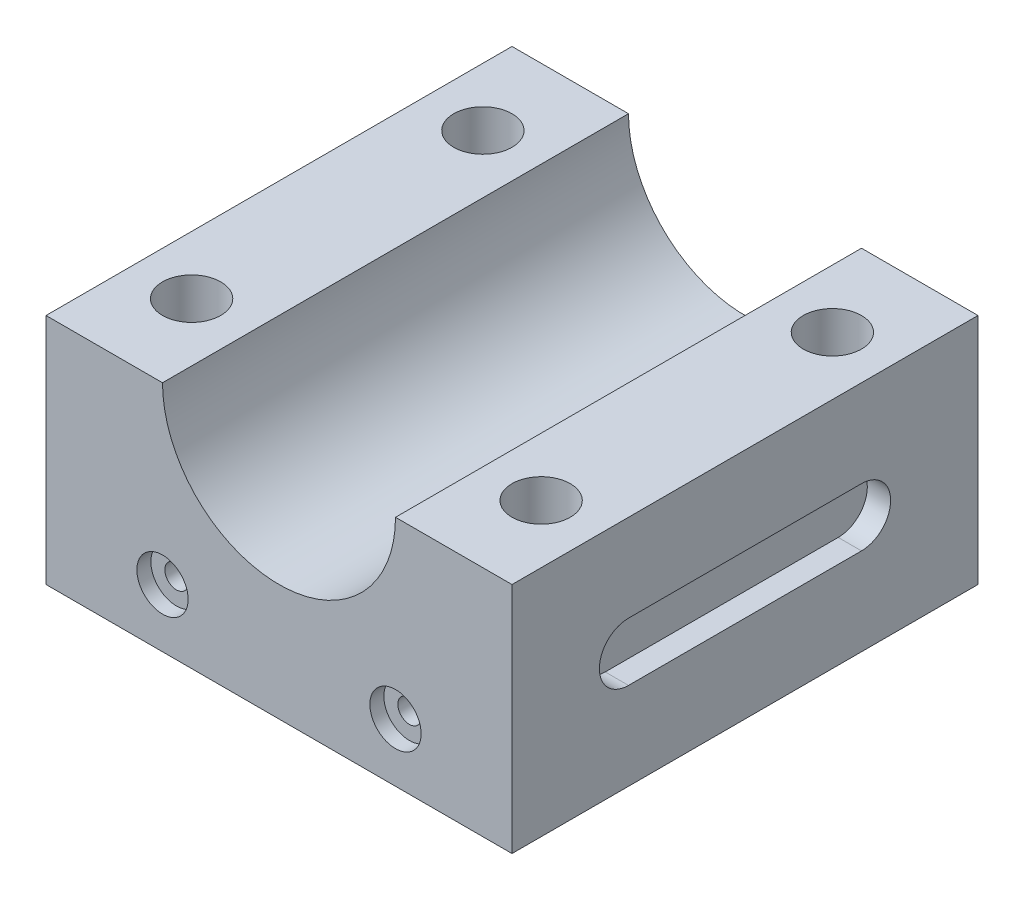
ISO-10303-21;
HEADER;
FILE_DESCRIPTION(('STEP AP214'),'2;1');
FILE_NAME('part.step','',(''),(''),'','','');
FILE_SCHEMA(('AUTOMOTIVE_DESIGN { 1 0 10303 214 1 1 1 1 }'));
ENDSEC;
DATA;
#1=APPLICATION_CONTEXT('core data for automotive mechanical design processes');
#2=APPLICATION_PROTOCOL_DEFINITION('international standard','automotive_design',2000,#1);
#3=PRODUCT_CONTEXT('',#1,'mechanical');
#4=PRODUCT('Part','Part','',(#3));
#5=PRODUCT_RELATED_PRODUCT_CATEGORY('part','',(#4));
#6=PRODUCT_DEFINITION_FORMATION('','',#4);
#7=PRODUCT_DEFINITION_CONTEXT('part definition',#1,'design');
#8=PRODUCT_DEFINITION('design','',#6,#7);
#9=PRODUCT_DEFINITION_SHAPE('','',#8);
#10=(LENGTH_UNIT() NAMED_UNIT(*) SI_UNIT(.MILLI.,.METRE.));
#11=(NAMED_UNIT(*) PLANE_ANGLE_UNIT() SI_UNIT($,.RADIAN.));
#12=(NAMED_UNIT(*) SI_UNIT($,.STERADIAN.) SOLID_ANGLE_UNIT());
#13=UNCERTAINTY_MEASURE_WITH_UNIT(LENGTH_MEASURE(1.E-05),#10,'distance_accuracy_value','');
#14=(GEOMETRIC_REPRESENTATION_CONTEXT(3) GLOBAL_UNCERTAINTY_ASSIGNED_CONTEXT((#13)) GLOBAL_UNIT_ASSIGNED_CONTEXT((#10,
#11,#12)) REPRESENTATION_CONTEXT('',''));
#15=CARTESIAN_POINT('',(0.,0.,0.));
#16=DIRECTION('',(0.,0.,1.));
#17=DIRECTION('',(1.,0.,0.));
#18=AXIS2_PLACEMENT_3D('',#15,#16,#17);
#19=CARTESIAN_POINT('',(50.8,-25.4,50.8));
#20=DIRECTION('',(-1.,0.,0.));
#21=DIRECTION('',(0.,0.,1.));
#22=AXIS2_PLACEMENT_3D('',#19,#20,#21);
#23=PLANE('',#22);
#24=DIRECTION('',(0.,0.,-1.));
#25=VECTOR('',#24,1.);
#26=CARTESIAN_POINT('',(50.8,-6.35,25.4));
#27=LINE('',#26,#25);
#28=CARTESIAN_POINT('',(50.8,-6.35,25.4));
#29=VERTEX_POINT('',#28);
#30=CARTESIAN_POINT('',(50.8,-6.34999999999999,-25.4));
#31=VERTEX_POINT('',#30);
#32=EDGE_CURVE('E229',#29,#31,#27,.T.);
#33=ORIENTED_EDGE('',*,*,#32,.F.);
#34=CARTESIAN_POINT('',(50.8,0.,25.4));
#35=DIRECTION('',(1.,0.,0.));
#36=DIRECTION('',(0.,0.,-1.));
#37=AXIS2_PLACEMENT_3D('',#34,#35,#36);
#38=CIRCLE('',#37,6.35);
#39=CARTESIAN_POINT('',(50.8,6.35,25.4));
#40=VERTEX_POINT('',#39);
#41=EDGE_CURVE('E53',#40,#29,#38,.T.);
#42=ORIENTED_EDGE('',*,*,#41,.F.);
#43=DIRECTION('',(0.,0.,1.));
#44=VECTOR('',#43,1.);
#45=CARTESIAN_POINT('',(50.8,6.35,25.4));
#46=LINE('',#45,#44);
#47=CARTESIAN_POINT('',(50.8,6.35000000000001,-25.4));
#48=VERTEX_POINT('',#47);
#49=EDGE_CURVE('E222',#48,#40,#46,.T.);
#50=ORIENTED_EDGE('',*,*,#49,.F.);
#51=CARTESIAN_POINT('',(50.8,0.,-25.4));
#52=DIRECTION('',(1.,0.,0.));
#53=DIRECTION('',(0.,0.,-1.));
#54=AXIS2_PLACEMENT_3D('',#51,#52,#53);
#55=CIRCLE('',#54,6.35);
#56=EDGE_CURVE('E226',#31,#48,#55,.T.);
#57=ORIENTED_EDGE('',*,*,#56,.F.);
#58=EDGE_LOOP('',(#33,#42,#50,#57));
#59=FACE_BOUND('',#58,.T.);
#60=DIRECTION('',(0.,1.,0.));
#61=VECTOR('',#60,1.);
#62=CARTESIAN_POINT('',(50.8,-25.4,-50.8));
#63=LINE('',#62,#61);
#64=CARTESIAN_POINT('',(50.8,-25.4,-50.8));
#65=VERTEX_POINT('',#64);
#66=CARTESIAN_POINT('',(50.8,25.4,-50.8));
#67=VERTEX_POINT('',#66);
#68=EDGE_CURVE('E135',#65,#67,#63,.T.);
#69=ORIENTED_EDGE('',*,*,#68,.T.);
#70=DIRECTION('',(0.,0.,-1.));
#71=VECTOR('',#70,1.);
#72=CARTESIAN_POINT('',(50.8,25.4,50.8));
#73=LINE('',#72,#71);
#74=CARTESIAN_POINT('',(50.8,25.4,50.8));
#75=VERTEX_POINT('',#74);
#76=EDGE_CURVE('E11',#75,#67,#73,.T.);
#77=ORIENTED_EDGE('',*,*,#76,.F.);
#78=DIRECTION('',(0.,1.,0.));
#79=VECTOR('',#78,1.);
#80=CARTESIAN_POINT('',(50.8,-25.4,50.8));
#81=LINE('',#80,#79);
#82=CARTESIAN_POINT('',(50.8,-25.4,50.8));
#83=VERTEX_POINT('',#82);
#84=EDGE_CURVE('E147',#83,#75,#81,.T.);
#85=ORIENTED_EDGE('',*,*,#84,.F.);
#86=DIRECTION('',(0.,0.,-1.));
#87=VECTOR('',#86,1.);
#88=CARTESIAN_POINT('',(50.8,-25.4,50.8));
#89=LINE('',#88,#87);
#90=EDGE_CURVE('E131',#83,#65,#89,.T.);
#91=ORIENTED_EDGE('',*,*,#90,.T.);
#92=EDGE_LOOP('',(#69,#77,#85,#91));
#93=FACE_BOUND('',#92,.T.);
#94=ADVANCED_FACE('F39',(#59,#93),#23,.F.);
#95=CARTESIAN_POINT('',(25.4,25.4,50.8));
#96=DIRECTION('',(0.,-1.,0.));
#97=DIRECTION('',(0.,0.,-1.));
#98=AXIS2_PLACEMENT_3D('',#95,#96,#97);
#99=PLANE('',#98);
#100=CARTESIAN_POINT('',(38.1,25.4,-31.75));
#101=DIRECTION('',(0.,1.,0.));
#102=DIRECTION('',(-1.,0.,0.));
#103=AXIS2_PLACEMENT_3D('',#100,#101,#102);
#104=CIRCLE('',#103,6.35);
#105=CARTESIAN_POINT('',(31.75,25.4000000000001,-31.75));
#106=VERTEX_POINT('',#105);
#107=EDGE_CURVE('E177',#106,#106,#104,.T.);
#108=ORIENTED_EDGE('',*,*,#107,.F.);
#109=EDGE_LOOP('',(#108));
#110=FACE_BOUND('',#109,.T.);
#111=CARTESIAN_POINT('',(38.1,25.4,31.75));
#112=DIRECTION('',(0.,1.,0.));
#113=DIRECTION('',(-1.,0.,0.));
#114=AXIS2_PLACEMENT_3D('',#111,#112,#113);
#115=CIRCLE('',#114,6.35);
#116=CARTESIAN_POINT('',(31.75,25.4000000000001,31.75));
#117=VERTEX_POINT('',#116);
#118=EDGE_CURVE('E170',#117,#117,#115,.T.);
#119=ORIENTED_EDGE('',*,*,#118,.F.);
#120=EDGE_LOOP('',(#119));
#121=FACE_BOUND('',#120,.T.);
#122=DIRECTION('',(-1.,0.,0.));
#123=VECTOR('',#122,1.);
#124=CARTESIAN_POINT('',(25.4,25.4,-50.8));
#125=LINE('',#124,#123);
#126=CARTESIAN_POINT('',(25.4,25.4,-50.8));
#127=VERTEX_POINT('',#126);
#128=EDGE_CURVE('E138',#67,#127,#125,.T.);
#129=ORIENTED_EDGE('',*,*,#128,.T.);
#130=DIRECTION('',(0.,0.,-1.));
#131=VECTOR('',#130,1.);
#132=CARTESIAN_POINT('',(25.4,25.4,50.8));
#133=LINE('',#132,#131);
#134=CARTESIAN_POINT('',(25.4,25.4,50.8));
#135=VERTEX_POINT('',#134);
#136=EDGE_CURVE('E46',#135,#127,#133,.T.);
#137=ORIENTED_EDGE('',*,*,#136,.F.);
#138=DIRECTION('',(-1.,0.,0.));
#139=VECTOR('',#138,1.);
#140=CARTESIAN_POINT('',(25.4,25.4,50.8));
#141=LINE('',#140,#139);
#142=EDGE_CURVE('E97',#75,#135,#141,.T.);
#143=ORIENTED_EDGE('',*,*,#142,.F.);
#144=ORIENTED_EDGE('',*,*,#76,.T.);
#145=EDGE_LOOP('',(#129,#137,#143,#144));
#146=FACE_BOUND('',#145,.T.);
#147=ADVANCED_FACE('F282',(#110,#121,#146),#99,.F.);
#148=CARTESIAN_POINT('',(0.,25.4,50.8));
#149=DIRECTION('',(0.,0.,-1.));
#150=DIRECTION('',(-1.,0.,0.));
#151=AXIS2_PLACEMENT_3D('',#148,#149,#150);
#152=CYLINDRICAL_SURFACE('',#151,25.4);
#153=CARTESIAN_POINT('',(0.,25.4,-50.8));
#154=DIRECTION('',(0.,0.,-1.));
#155=DIRECTION('',(1.,0.,0.));
#156=AXIS2_PLACEMENT_3D('',#153,#154,#155);
#157=CIRCLE('',#156,25.4);
#158=CARTESIAN_POINT('',(-25.4,25.4,-50.8));
#159=VERTEX_POINT('',#158);
#160=EDGE_CURVE('E141',#127,#159,#157,.T.);
#161=ORIENTED_EDGE('',*,*,#160,.T.);
#162=DIRECTION('',(0.,0.,-1.));
#163=VECTOR('',#162,1.);
#164=CARTESIAN_POINT('',(-25.4,25.4,50.8));
#165=LINE('',#164,#163);
#166=CARTESIAN_POINT('',(-25.4,25.4,50.8));
#167=VERTEX_POINT('',#166);
#168=EDGE_CURVE('E126',#167,#159,#165,.T.);
#169=ORIENTED_EDGE('',*,*,#168,.F.);
#170=CARTESIAN_POINT('',(0.,25.4,50.8));
#171=DIRECTION('',(0.,0.,-1.));
#172=DIRECTION('',(1.,0.,0.));
#173=AXIS2_PLACEMENT_3D('',#170,#171,#172);
#174=CIRCLE('',#173,25.4);
#175=EDGE_CURVE('E114',#135,#167,#174,.T.);
#176=ORIENTED_EDGE('',*,*,#175,.F.);
#177=ORIENTED_EDGE('',*,*,#136,.T.);
#178=EDGE_LOOP('',(#161,#169,#176,#177));
#179=FACE_BOUND('',#178,.T.);
#180=ADVANCED_FACE('F153',(#179),#152,.F.);
#181=CARTESIAN_POINT('',(-50.8,25.4,50.8));
#182=DIRECTION('',(0.,-1.,0.));
#183=DIRECTION('',(0.,0.,-1.));
#184=AXIS2_PLACEMENT_3D('',#181,#182,#183);
#185=PLANE('',#184);
#186=CARTESIAN_POINT('',(-38.1,25.4,31.75));
#187=DIRECTION('',(0.,1.,0.));
#188=DIRECTION('',(-1.,0.,0.));
#189=AXIS2_PLACEMENT_3D('',#186,#187,#188);
#190=CIRCLE('',#189,6.35);
#191=CARTESIAN_POINT('',(-44.45,25.4,31.75));
#192=VERTEX_POINT('',#191);
#193=EDGE_CURVE('E183',#192,#192,#190,.T.);
#194=ORIENTED_EDGE('',*,*,#193,.F.);
#195=EDGE_LOOP('',(#194));
#196=FACE_BOUND('',#195,.T.);
#197=CARTESIAN_POINT('',(-38.1,25.4,-31.75));
#198=DIRECTION('',(0.,1.,0.));
#199=DIRECTION('',(-1.,0.,0.));
#200=AXIS2_PLACEMENT_3D('',#197,#198,#199);
#201=CIRCLE('',#200,6.35);
#202=CARTESIAN_POINT('',(-44.45,25.4,-31.75));
#203=VERTEX_POINT('',#202);
#204=EDGE_CURVE('E164',#203,#203,#201,.T.);
#205=ORIENTED_EDGE('',*,*,#204,.F.);
#206=EDGE_LOOP('',(#205));
#207=FACE_BOUND('',#206,.T.);
#208=DIRECTION('',(-1.,0.,0.));
#209=VECTOR('',#208,1.);
#210=CARTESIAN_POINT('',(-50.8,25.4,-50.8));
#211=LINE('',#210,#209);
#212=CARTESIAN_POINT('',(-50.8,25.4,-50.8));
#213=VERTEX_POINT('',#212);
#214=EDGE_CURVE('E123',#159,#213,#211,.T.);
#215=ORIENTED_EDGE('',*,*,#214,.T.);
#216=DIRECTION('',(0.,0.,-1.));
#217=VECTOR('',#216,1.);
#218=CARTESIAN_POINT('',(-50.8,25.4,50.8));
#219=LINE('',#218,#217);
#220=CARTESIAN_POINT('',(-50.8,25.4,50.8));
#221=VERTEX_POINT('',#220);
#222=EDGE_CURVE('E120',#221,#213,#219,.T.);
#223=ORIENTED_EDGE('',*,*,#222,.F.);
#224=DIRECTION('',(-1.,0.,0.));
#225=VECTOR('',#224,1.);
#226=CARTESIAN_POINT('',(-50.8,25.4,50.8));
#227=LINE('',#226,#225);
#228=EDGE_CURVE('E107',#167,#221,#227,.T.);
#229=ORIENTED_EDGE('',*,*,#228,.F.);
#230=ORIENTED_EDGE('',*,*,#168,.T.);
#231=EDGE_LOOP('',(#215,#223,#229,#230));
#232=FACE_BOUND('',#231,.T.);
#233=ADVANCED_FACE('F121',(#196,#207,#232),#185,.F.);
#234=CARTESIAN_POINT('',(-50.8,-25.4,50.8));
#235=DIRECTION('',(1.,0.,0.));
#236=DIRECTION('',(0.,0.,-1.));
#237=AXIS2_PLACEMENT_3D('',#234,#235,#236);
#238=PLANE('',#237);
#239=DIRECTION('',(0.,-1.,0.));
#240=VECTOR('',#239,1.);
#241=CARTESIAN_POINT('',(-50.8,-25.4,-50.8));
#242=LINE('',#241,#240);
#243=CARTESIAN_POINT('',(-50.8,-25.4,-50.8));
#244=VERTEX_POINT('',#243);
#245=EDGE_CURVE('E144',#213,#244,#242,.T.);
#246=ORIENTED_EDGE('',*,*,#245,.T.);
#247=DIRECTION('',(0.,0.,-1.));
#248=VECTOR('',#247,1.);
#249=CARTESIAN_POINT('',(-50.8,-25.4,50.8));
#250=LINE('',#249,#248);
#251=CARTESIAN_POINT('',(-50.8,-25.4,50.8));
#252=VERTEX_POINT('',#251);
#253=EDGE_CURVE('E127',#252,#244,#250,.T.);
#254=ORIENTED_EDGE('',*,*,#253,.F.);
#255=DIRECTION('',(0.,-1.,0.));
#256=VECTOR('',#255,1.);
#257=CARTESIAN_POINT('',(-50.8,-25.4,50.8));
#258=LINE('',#257,#256);
#259=EDGE_CURVE('E111',#221,#252,#258,.T.);
#260=ORIENTED_EDGE('',*,*,#259,.F.);
#261=ORIENTED_EDGE('',*,*,#222,.T.);
#262=EDGE_LOOP('',(#246,#254,#260,#261));
#263=FACE_BOUND('',#262,.T.);
#264=ADVANCED_FACE('F129',(#263),#238,.F.);
#265=CARTESIAN_POINT('',(-50.8,-25.4,50.8));
#266=DIRECTION('',(0.,1.,0.));
#267=DIRECTION('',(0.,0.,1.));
#268=AXIS2_PLACEMENT_3D('',#265,#266,#267);
#269=PLANE('',#268);
#270=CARTESIAN_POINT('',(-38.1000000000001,-25.4,31.75));
#271=DIRECTION('',(0.,1.,0.));
#272=DIRECTION('',(-1.,0.,0.));
#273=AXIS2_PLACEMENT_3D('',#270,#271,#272);
#274=CIRCLE('',#273,6.35);
#275=CARTESIAN_POINT('',(-44.4500000000001,-25.4,31.75));
#276=VERTEX_POINT('',#275);
#277=EDGE_CURVE('E167',#276,#276,#274,.T.);
#278=ORIENTED_EDGE('',*,*,#277,.T.);
#279=EDGE_LOOP('',(#278));
#280=FACE_BOUND('',#279,.T.);
#281=CARTESIAN_POINT('',(38.0999999999999,-25.4000000000001,-31.75));
#282=DIRECTION('',(0.,1.,0.));
#283=DIRECTION('',(-1.,0.,0.));
#284=AXIS2_PLACEMENT_3D('',#281,#282,#283);
#285=CIRCLE('',#284,6.35);
#286=CARTESIAN_POINT('',(31.7499999999999,-25.4000000000001,-31.75));
#287=VERTEX_POINT('',#286);
#288=EDGE_CURVE('E180',#287,#287,#285,.T.);
#289=ORIENTED_EDGE('',*,*,#288,.T.);
#290=EDGE_LOOP('',(#289));
#291=FACE_BOUND('',#290,.T.);
#292=CARTESIAN_POINT('',(38.0999999999999,-25.4000000000001,31.75));
#293=DIRECTION('',(0.,1.,0.));
#294=DIRECTION('',(-1.,0.,0.));
#295=AXIS2_PLACEMENT_3D('',#292,#293,#294);
#296=CIRCLE('',#295,6.35);
#297=CARTESIAN_POINT('',(31.7499999999999,-25.4000000000001,31.75));
#298=VERTEX_POINT('',#297);
#299=EDGE_CURVE('E173',#298,#298,#296,.T.);
#300=ORIENTED_EDGE('',*,*,#299,.T.);
#301=EDGE_LOOP('',(#300));
#302=FACE_BOUND('',#301,.T.);
#303=CARTESIAN_POINT('',(-38.1000000000001,-25.4,-31.75));
#304=DIRECTION('',(0.,1.,0.));
#305=DIRECTION('',(-1.,0.,0.));
#306=AXIS2_PLACEMENT_3D('',#303,#304,#305);
#307=CIRCLE('',#306,6.35);
#308=CARTESIAN_POINT('',(-44.4500000000001,-25.4,-31.75));
#309=VERTEX_POINT('',#308);
#310=EDGE_CURVE('E139',#309,#309,#307,.T.);
#311=ORIENTED_EDGE('',*,*,#310,.T.);
#312=EDGE_LOOP('',(#311));
#313=FACE_BOUND('',#312,.T.);
#314=DIRECTION('',(1.,0.,0.));
#315=VECTOR('',#314,1.);
#316=CARTESIAN_POINT('',(-50.8,-25.4,-50.8));
#317=LINE('',#316,#315);
#318=EDGE_CURVE('E89',#244,#65,#317,.T.);
#319=ORIENTED_EDGE('',*,*,#318,.T.);
#320=ORIENTED_EDGE('',*,*,#90,.F.);
#321=DIRECTION('',(1.,0.,0.));
#322=VECTOR('',#321,1.);
#323=CARTESIAN_POINT('',(-50.8,-25.4,50.8));
#324=LINE('',#323,#322);
#325=EDGE_CURVE('E62',#252,#83,#324,.T.);
#326=ORIENTED_EDGE('',*,*,#325,.F.);
#327=ORIENTED_EDGE('',*,*,#253,.T.);
#328=EDGE_LOOP('',(#319,#320,#326,#327));
#329=FACE_BOUND('',#328,.T.);
#330=ADVANCED_FACE('F157',(#280,#291,#302,#313,#329),#269,.F.);
#331=CARTESIAN_POINT('',(0.,25.4,50.8));
#332=DIRECTION('',(0.,0.,1.));
#333=DIRECTION('',(1.,0.,0.));
#334=AXIS2_PLACEMENT_3D('',#331,#332,#333);
#335=PLANE('',#334);
#336=CARTESIAN_POINT('',(-25.4,-12.7,50.8));
#337=DIRECTION('',(0.,0.,1.));
#338=DIRECTION('',(1.,0.,0.));
#339=AXIS2_PLACEMENT_3D('',#336,#337,#338);
#340=CIRCLE('',#339,5.588);
#341=CARTESIAN_POINT('',(-19.812,-12.7,50.8));
#342=VERTEX_POINT('',#341);
#343=EDGE_CURVE('E208',#342,#342,#340,.T.);
#344=ORIENTED_EDGE('',*,*,#343,.F.);
#345=EDGE_LOOP('',(#344));
#346=FACE_BOUND('',#345,.T.);
#347=CARTESIAN_POINT('',(25.4,-12.7,50.8));
#348=DIRECTION('',(0.,0.,1.));
#349=DIRECTION('',(1.,0.,0.));
#350=AXIS2_PLACEMENT_3D('',#347,#348,#349);
#351=CIRCLE('',#350,5.588);
#352=CARTESIAN_POINT('',(30.988,-12.7,50.8));
#353=VERTEX_POINT('',#352);
#354=EDGE_CURVE('E196',#353,#353,#351,.T.);
#355=ORIENTED_EDGE('',*,*,#354,.F.);
#356=EDGE_LOOP('',(#355));
#357=FACE_BOUND('',#356,.T.);
#358=ORIENTED_EDGE('',*,*,#84,.T.);
#359=ORIENTED_EDGE('',*,*,#142,.T.);
#360=ORIENTED_EDGE('',*,*,#175,.T.);
#361=ORIENTED_EDGE('',*,*,#228,.T.);
#362=ORIENTED_EDGE('',*,*,#259,.T.);
#363=ORIENTED_EDGE('',*,*,#325,.T.);
#364=EDGE_LOOP('',(#358,#359,#360,#361,#362,#363));
#365=FACE_BOUND('',#364,.T.);
#366=ADVANCED_FACE('F109',(#346,#357,#365),#335,.T.);
#367=CARTESIAN_POINT('',(0.,25.4,-50.8));
#368=DIRECTION('',(0.,0.,1.));
#369=DIRECTION('',(1.,0.,0.));
#370=AXIS2_PLACEMENT_3D('',#367,#368,#369);
#371=PLANE('',#370);
#372=CARTESIAN_POINT('',(-25.4,-12.7,-50.8));
#373=DIRECTION('',(0.,0.,1.));
#374=DIRECTION('',(1.,0.,0.));
#375=AXIS2_PLACEMENT_3D('',#372,#373,#374);
#376=CIRCLE('',#375,2.53999999999998);
#377=CARTESIAN_POINT('',(-22.86,-12.7,-50.8));
#378=VERTEX_POINT('',#377);
#379=EDGE_CURVE('E199',#378,#378,#376,.T.);
#380=ORIENTED_EDGE('',*,*,#379,.T.);
#381=EDGE_LOOP('',(#380));
#382=FACE_BOUND('',#381,.T.);
#383=CARTESIAN_POINT('',(25.4,-12.7,-50.8));
#384=DIRECTION('',(0.,0.,1.));
#385=DIRECTION('',(1.,0.,0.));
#386=AXIS2_PLACEMENT_3D('',#383,#384,#385);
#387=CIRCLE('',#386,2.53999999999998);
#388=CARTESIAN_POINT('',(27.94,-12.7,-50.8));
#389=VERTEX_POINT('',#388);
#390=EDGE_CURVE('E174',#389,#389,#387,.T.);
#391=ORIENTED_EDGE('',*,*,#390,.T.);
#392=EDGE_LOOP('',(#391));
#393=FACE_BOUND('',#392,.T.);
#394=ORIENTED_EDGE('',*,*,#68,.F.);
#395=ORIENTED_EDGE('',*,*,#318,.F.);
#396=ORIENTED_EDGE('',*,*,#245,.F.);
#397=ORIENTED_EDGE('',*,*,#214,.F.);
#398=ORIENTED_EDGE('',*,*,#160,.F.);
#399=ORIENTED_EDGE('',*,*,#128,.F.);
#400=EDGE_LOOP('',(#394,#395,#396,#397,#398,#399));
#401=FACE_BOUND('',#400,.T.);
#402=ADVANCED_FACE('F156',(#382,#393,#401),#371,.F.);
#403=CARTESIAN_POINT('',(-38.1000000000001,-25.4,-31.75));
#404=DIRECTION('',(0.,1.,0.));
#405=DIRECTION('',(-1.,0.,0.));
#406=AXIS2_PLACEMENT_3D('',#403,#404,#405);
#407=CYLINDRICAL_SURFACE('',#406,6.35);
#408=ORIENTED_EDGE('',*,*,#310,.F.);
#409=EDGE_LOOP('',(#408));
#410=FACE_BOUND('',#409,.T.);
#411=ORIENTED_EDGE('',*,*,#204,.T.);
#412=EDGE_LOOP('',(#411));
#413=FACE_BOUND('',#412,.T.);
#414=ADVANCED_FACE('F306',(#410,#413),#407,.F.);
#415=CARTESIAN_POINT('',(38.0999999999999,-25.4000000000001,31.75));
#416=DIRECTION('',(0.,1.,0.));
#417=DIRECTION('',(-1.,0.,0.));
#418=AXIS2_PLACEMENT_3D('',#415,#416,#417);
#419=CYLINDRICAL_SURFACE('',#418,6.35);
#420=ORIENTED_EDGE('',*,*,#299,.F.);
#421=EDGE_LOOP('',(#420));
#422=FACE_BOUND('',#421,.T.);
#423=ORIENTED_EDGE('',*,*,#118,.T.);
#424=EDGE_LOOP('',(#423));
#425=FACE_BOUND('',#424,.T.);
#426=ADVANCED_FACE('F313',(#422,#425),#419,.F.);
#427=CARTESIAN_POINT('',(38.0999999999999,-25.4000000000001,-31.75));
#428=DIRECTION('',(0.,1.,0.));
#429=DIRECTION('',(-1.,0.,0.));
#430=AXIS2_PLACEMENT_3D('',#427,#428,#429);
#431=CYLINDRICAL_SURFACE('',#430,6.35);
#432=ORIENTED_EDGE('',*,*,#288,.F.);
#433=EDGE_LOOP('',(#432));
#434=FACE_BOUND('',#433,.T.);
#435=ORIENTED_EDGE('',*,*,#107,.T.);
#436=EDGE_LOOP('',(#435));
#437=FACE_BOUND('',#436,.T.);
#438=ADVANCED_FACE('F317',(#434,#437),#431,.F.);
#439=CARTESIAN_POINT('',(-38.1000000000001,-25.4,31.75));
#440=DIRECTION('',(0.,1.,0.));
#441=DIRECTION('',(-1.,0.,0.));
#442=AXIS2_PLACEMENT_3D('',#439,#440,#441);
#443=CYLINDRICAL_SURFACE('',#442,6.35);
#444=ORIENTED_EDGE('',*,*,#277,.F.);
#445=EDGE_LOOP('',(#444));
#446=FACE_BOUND('',#445,.T.);
#447=ORIENTED_EDGE('',*,*,#193,.T.);
#448=EDGE_LOOP('',(#447));
#449=FACE_BOUND('',#448,.T.);
#450=ADVANCED_FACE('F321',(#446,#449),#443,.F.);
#451=CARTESIAN_POINT('',(25.4,-12.7,50.8));
#452=DIRECTION('',(0.,0.,1.));
#453=DIRECTION('',(1.,0.,0.));
#454=AXIS2_PLACEMENT_3D('',#451,#452,#453);
#455=CYLINDRICAL_SURFACE('',#454,2.53999999999999);
#456=ORIENTED_EDGE('',*,*,#390,.F.);
#457=EDGE_LOOP('',(#456));
#458=FACE_BOUND('',#457,.T.);
#459=CARTESIAN_POINT('',(25.4,-12.7,47.752));
#460=DIRECTION('',(0.,0.,1.));
#461=DIRECTION('',(1.,0.,0.));
#462=AXIS2_PLACEMENT_3D('',#459,#460,#461);
#463=CIRCLE('',#462,2.54000000000001);
#464=CARTESIAN_POINT('',(27.94,-12.7,47.752));
#465=VERTEX_POINT('',#464);
#466=EDGE_CURVE('E190',#465,#465,#463,.T.);
#467=ORIENTED_EDGE('',*,*,#466,.T.);
#468=EDGE_LOOP('',(#467));
#469=FACE_BOUND('',#468,.T.);
#470=ADVANCED_FACE('F325',(#458,#469),#455,.F.);
#471=CARTESIAN_POINT('',(27.94,-12.7,47.752));
#472=DIRECTION('',(0.,0.,-1.));
#473=DIRECTION('',(-1.,0.,0.));
#474=AXIS2_PLACEMENT_3D('',#471,#472,#473);
#475=PLANE('',#474);
#476=ORIENTED_EDGE('',*,*,#466,.F.);
#477=EDGE_LOOP('',(#476));
#478=FACE_BOUND('',#477,.T.);
#479=CARTESIAN_POINT('',(25.4,-12.7,47.752));
#480=DIRECTION('',(0.,0.,1.));
#481=DIRECTION('',(1.,0.,0.));
#482=AXIS2_PLACEMENT_3D('',#479,#480,#481);
#483=CIRCLE('',#482,5.588);
#484=CARTESIAN_POINT('',(30.988,-12.7,47.752));
#485=VERTEX_POINT('',#484);
#486=EDGE_CURVE('E193',#485,#485,#483,.T.);
#487=ORIENTED_EDGE('',*,*,#486,.T.);
#488=EDGE_LOOP('',(#487));
#489=FACE_BOUND('',#488,.T.);
#490=ADVANCED_FACE('F329',(#478,#489),#475,.F.);
#491=CARTESIAN_POINT('',(25.4,-12.7,50.8));
#492=DIRECTION('',(0.,0.,1.));
#493=DIRECTION('',(1.,0.,0.));
#494=AXIS2_PLACEMENT_3D('',#491,#492,#493);
#495=CYLINDRICAL_SURFACE('',#494,5.588);
#496=ORIENTED_EDGE('',*,*,#486,.F.);
#497=EDGE_LOOP('',(#496));
#498=FACE_BOUND('',#497,.T.);
#499=ORIENTED_EDGE('',*,*,#354,.T.);
#500=EDGE_LOOP('',(#499));
#501=FACE_BOUND('',#500,.T.);
#502=ADVANCED_FACE('F333',(#498,#501),#495,.F.);
#503=CARTESIAN_POINT('',(-25.4,-12.7,50.8));
#504=DIRECTION('',(0.,0.,1.));
#505=DIRECTION('',(1.,0.,0.));
#506=AXIS2_PLACEMENT_3D('',#503,#504,#505);
#507=CYLINDRICAL_SURFACE('',#506,2.53999999999999);
#508=ORIENTED_EDGE('',*,*,#379,.F.);
#509=EDGE_LOOP('',(#508));
#510=FACE_BOUND('',#509,.T.);
#511=CARTESIAN_POINT('',(-25.4,-12.7,47.752));
#512=DIRECTION('',(0.,0.,1.));
#513=DIRECTION('',(1.,0.,0.));
#514=AXIS2_PLACEMENT_3D('',#511,#512,#513);
#515=CIRCLE('',#514,2.54000000000001);
#516=CARTESIAN_POINT('',(-22.86,-12.7,47.752));
#517=VERTEX_POINT('',#516);
#518=EDGE_CURVE('E202',#517,#517,#515,.T.);
#519=ORIENTED_EDGE('',*,*,#518,.T.);
#520=EDGE_LOOP('',(#519));
#521=FACE_BOUND('',#520,.T.);
#522=ADVANCED_FACE('F337',(#510,#521),#507,.F.);
#523=CARTESIAN_POINT('',(-22.86,-12.7,47.752));
#524=DIRECTION('',(0.,0.,-1.));
#525=DIRECTION('',(-1.,0.,0.));
#526=AXIS2_PLACEMENT_3D('',#523,#524,#525);
#527=PLANE('',#526);
#528=ORIENTED_EDGE('',*,*,#518,.F.);
#529=EDGE_LOOP('',(#528));
#530=FACE_BOUND('',#529,.T.);
#531=CARTESIAN_POINT('',(-25.4,-12.7,47.752));
#532=DIRECTION('',(0.,0.,1.));
#533=DIRECTION('',(1.,0.,0.));
#534=AXIS2_PLACEMENT_3D('',#531,#532,#533);
#535=CIRCLE('',#534,5.588);
#536=CARTESIAN_POINT('',(-19.812,-12.7,47.752));
#537=VERTEX_POINT('',#536);
#538=EDGE_CURVE('E205',#537,#537,#535,.T.);
#539=ORIENTED_EDGE('',*,*,#538,.T.);
#540=EDGE_LOOP('',(#539));
#541=FACE_BOUND('',#540,.T.);
#542=ADVANCED_FACE('F341',(#530,#541),#527,.F.);
#543=CARTESIAN_POINT('',(-25.4,-12.7,50.8));
#544=DIRECTION('',(0.,0.,1.));
#545=DIRECTION('',(1.,0.,0.));
#546=AXIS2_PLACEMENT_3D('',#543,#544,#545);
#547=CYLINDRICAL_SURFACE('',#546,5.588);
#548=ORIENTED_EDGE('',*,*,#538,.F.);
#549=EDGE_LOOP('',(#548));
#550=FACE_BOUND('',#549,.T.);
#551=ORIENTED_EDGE('',*,*,#343,.T.);
#552=EDGE_LOOP('',(#551));
#553=FACE_BOUND('',#552,.T.);
#554=ADVANCED_FACE('F345',(#550,#553),#547,.F.);
#555=CARTESIAN_POINT('',(45.72,0.,25.4));
#556=DIRECTION('',(1.,0.,0.));
#557=DIRECTION('',(0.,0.,-1.));
#558=AXIS2_PLACEMENT_3D('',#555,#556,#557);
#559=CYLINDRICAL_SURFACE('',#558,6.35);
#560=ORIENTED_EDGE('',*,*,#41,.T.);
#561=DIRECTION('',(1.,0.,0.));
#562=VECTOR('',#561,1.);
#563=CARTESIAN_POINT('',(45.72,-6.35,25.4));
#564=LINE('',#563,#562);
#565=CARTESIAN_POINT('',(45.72,-6.35,25.4));
#566=VERTEX_POINT('',#565);
#567=EDGE_CURVE('E212',#566,#29,#564,.T.);
#568=ORIENTED_EDGE('',*,*,#567,.F.);
#569=CARTESIAN_POINT('',(45.72,0.,25.4));
#570=DIRECTION('',(1.,0.,0.));
#571=DIRECTION('',(0.,0.,-1.));
#572=AXIS2_PLACEMENT_3D('',#569,#570,#571);
#573=CIRCLE('',#572,6.35);
#574=CARTESIAN_POINT('',(45.72,6.35,25.4));
#575=VERTEX_POINT('',#574);
#576=EDGE_CURVE('E225',#575,#566,#573,.T.);
#577=ORIENTED_EDGE('',*,*,#576,.F.);
#578=DIRECTION('',(1.,0.,0.));
#579=VECTOR('',#578,1.);
#580=CARTESIAN_POINT('',(45.72,6.35,25.4));
#581=LINE('',#580,#579);
#582=EDGE_CURVE('E211',#575,#40,#581,.T.);
#583=ORIENTED_EDGE('',*,*,#582,.T.);
#584=EDGE_LOOP('',(#560,#568,#577,#583));
#585=FACE_BOUND('',#584,.T.);
#586=ADVANCED_FACE('F250',(#585),#559,.F.);
#587=CARTESIAN_POINT('',(45.72,6.35,25.4));
#588=DIRECTION('',(0.,1.,0.));
#589=DIRECTION('',(0.,0.,1.));
#590=AXIS2_PLACEMENT_3D('',#587,#588,#589);
#591=PLANE('',#590);
#592=ORIENTED_EDGE('',*,*,#49,.T.);
#593=ORIENTED_EDGE('',*,*,#582,.F.);
#594=DIRECTION('',(0.,0.,1.));
#595=VECTOR('',#594,1.);
#596=CARTESIAN_POINT('',(45.72,6.35,25.4));
#597=LINE('',#596,#595);
#598=CARTESIAN_POINT('',(45.72,6.35000000000001,-25.4));
#599=VERTEX_POINT('',#598);
#600=EDGE_CURVE('E215',#599,#575,#597,.T.);
#601=ORIENTED_EDGE('',*,*,#600,.F.);
#602=DIRECTION('',(1.,0.,0.));
#603=VECTOR('',#602,1.);
#604=CARTESIAN_POINT('',(45.72,6.35000000000001,-25.4));
#605=LINE('',#604,#603);
#606=EDGE_CURVE('E218',#599,#48,#605,.T.);
#607=ORIENTED_EDGE('',*,*,#606,.T.);
#608=EDGE_LOOP('',(#592,#593,#601,#607));
#609=FACE_BOUND('',#608,.T.);
#610=ADVANCED_FACE('F261',(#609),#591,.F.);
#611=CARTESIAN_POINT('',(45.72,0.,-25.4));
#612=DIRECTION('',(1.,0.,0.));
#613=DIRECTION('',(0.,0.,-1.));
#614=AXIS2_PLACEMENT_3D('',#611,#612,#613);
#615=CYLINDRICAL_SURFACE('',#614,6.35);
#616=ORIENTED_EDGE('',*,*,#56,.T.);
#617=ORIENTED_EDGE('',*,*,#606,.F.);
#618=CARTESIAN_POINT('',(45.72,0.,-25.4));
#619=DIRECTION('',(1.,0.,0.));
#620=DIRECTION('',(0.,0.,-1.));
#621=AXIS2_PLACEMENT_3D('',#618,#619,#620);
#622=CIRCLE('',#621,6.35);
#623=CARTESIAN_POINT('',(45.72,-6.34999999999999,-25.4));
#624=VERTEX_POINT('',#623);
#625=EDGE_CURVE('E235',#624,#599,#622,.T.);
#626=ORIENTED_EDGE('',*,*,#625,.F.);
#627=DIRECTION('',(1.,0.,0.));
#628=VECTOR('',#627,1.);
#629=CARTESIAN_POINT('',(45.72,-6.34999999999999,-25.4));
#630=LINE('',#629,#628);
#631=EDGE_CURVE('E214',#624,#31,#630,.T.);
#632=ORIENTED_EDGE('',*,*,#631,.T.);
#633=EDGE_LOOP('',(#616,#617,#626,#632));
#634=FACE_BOUND('',#633,.T.);
#635=ADVANCED_FACE('F266',(#634),#615,.F.);
#636=CARTESIAN_POINT('',(45.72,-6.35,25.4));
#637=DIRECTION('',(0.,-1.,0.));
#638=DIRECTION('',(0.,0.,-1.));
#639=AXIS2_PLACEMENT_3D('',#636,#637,#638);
#640=PLANE('',#639);
#641=ORIENTED_EDGE('',*,*,#32,.T.);
#642=ORIENTED_EDGE('',*,*,#631,.F.);
#643=DIRECTION('',(0.,0.,-1.));
#644=VECTOR('',#643,1.);
#645=CARTESIAN_POINT('',(45.72,-6.35,25.4));
#646=LINE('',#645,#644);
#647=EDGE_CURVE('E238',#566,#624,#646,.T.);
#648=ORIENTED_EDGE('',*,*,#647,.F.);
#649=ORIENTED_EDGE('',*,*,#567,.T.);
#650=EDGE_LOOP('',(#641,#642,#648,#649));
#651=FACE_BOUND('',#650,.T.);
#652=ADVANCED_FACE('F271',(#651),#640,.F.);
#653=CARTESIAN_POINT('',(45.72,0.,25.4));
#654=DIRECTION('',(1.,0.,0.));
#655=DIRECTION('',(0.,0.,-1.));
#656=AXIS2_PLACEMENT_3D('',#653,#654,#655);
#657=PLANE('',#656);
#658=ORIENTED_EDGE('',*,*,#576,.T.);
#659=ORIENTED_EDGE('',*,*,#647,.T.);
#660=ORIENTED_EDGE('',*,*,#625,.T.);
#661=ORIENTED_EDGE('',*,*,#600,.T.);
#662=EDGE_LOOP('',(#658,#659,#660,#661));
#663=FACE_BOUND('',#662,.T.);
#664=ADVANCED_FACE('F245',(#663),#657,.T.);
#665=CLOSED_SHELL('',(#94,#147,#180,#233,#264,#330,#366,#402,#414,#426,#438,#450,#470,#490,#502,
#522,#542,#554,#586,#610,#635,#652,#664));
#666=MANIFOLD_SOLID_BREP('B2',#665);
#667=ADVANCED_BREP_SHAPE_REPRESENTATION('',(#18,#666),#14);
#668=SHAPE_DEFINITION_REPRESENTATION(#9,#667);
ENDSEC;
END-ISO-10303-21;
